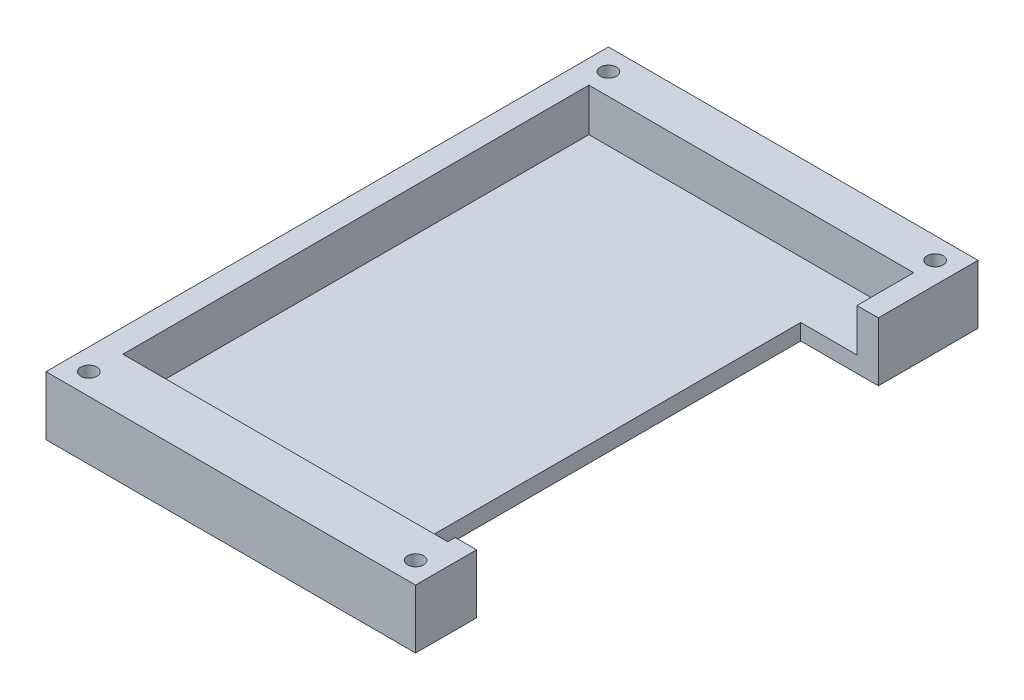
ISO-10303-21;
HEADER;
FILE_DESCRIPTION(('STEP AP214'),'2;1');
FILE_NAME('part.step','',(''),(''),'','','');
FILE_SCHEMA(('AUTOMOTIVE_DESIGN { 1 0 10303 214 1 1 1 1 }'));
ENDSEC;
DATA;
#1=APPLICATION_CONTEXT('core data for automotive mechanical design processes');
#2=APPLICATION_PROTOCOL_DEFINITION('international standard','automotive_design',2000,#1);
#3=PRODUCT_CONTEXT('',#1,'mechanical');
#4=PRODUCT('Part','Part','',(#3));
#5=PRODUCT_RELATED_PRODUCT_CATEGORY('part','',(#4));
#6=PRODUCT_DEFINITION_FORMATION('','',#4);
#7=PRODUCT_DEFINITION_CONTEXT('part definition',#1,'design');
#8=PRODUCT_DEFINITION('design','',#6,#7);
#9=PRODUCT_DEFINITION_SHAPE('','',#8);
#10=(LENGTH_UNIT() NAMED_UNIT(*) SI_UNIT(.MILLI.,.METRE.));
#11=(NAMED_UNIT(*) PLANE_ANGLE_UNIT() SI_UNIT($,.RADIAN.));
#12=(NAMED_UNIT(*) SI_UNIT($,.STERADIAN.) SOLID_ANGLE_UNIT());
#13=UNCERTAINTY_MEASURE_WITH_UNIT(LENGTH_MEASURE(1.E-05),#10,'distance_accuracy_value','');
#14=(GEOMETRIC_REPRESENTATION_CONTEXT(3) GLOBAL_UNCERTAINTY_ASSIGNED_CONTEXT((#13)) GLOBAL_UNIT_ASSIGNED_CONTEXT((#10,
#11,#12)) REPRESENTATION_CONTEXT('',''));
#15=CARTESIAN_POINT('',(0.,0.,0.));
#16=DIRECTION('',(0.,0.,1.));
#17=DIRECTION('',(1.,0.,0.));
#18=AXIS2_PLACEMENT_3D('',#15,#16,#17);
#19=CARTESIAN_POINT('',(69.,11.,0.));
#20=DIRECTION('',(-1.,0.,0.));
#21=DIRECTION('',(0.,0.,1.));
#22=AXIS2_PLACEMENT_3D('',#19,#20,#21);
#23=PLANE('',#22);
#24=DIRECTION('',(0.,0.,-1.));
#25=VECTOR('',#24,1.);
#26=CARTESIAN_POINT('',(69.,0.,0.));
#27=LINE('',#26,#25);
#28=CARTESIAN_POINT('',(69.,0.,0.));
#29=VERTEX_POINT('',#28);
#30=CARTESIAN_POINT('',(69.,0.,-11.4));
#31=VERTEX_POINT('',#30);
#32=EDGE_CURVE('E162',#29,#31,#27,.T.);
#33=ORIENTED_EDGE('',*,*,#32,.T.);
#34=DIRECTION('',(0.,1.,0.));
#35=VECTOR('',#34,1.);
#36=CARTESIAN_POINT('',(69.,0.,-11.4));
#37=LINE('',#36,#35);
#38=CARTESIAN_POINT('',(69.,11.,-11.4));
#39=VERTEX_POINT('',#38);
#40=EDGE_CURVE('E196',#31,#39,#37,.T.);
#41=ORIENTED_EDGE('',*,*,#40,.T.);
#42=DIRECTION('',(0.,0.,-1.));
#43=VECTOR('',#42,1.);
#44=CARTESIAN_POINT('',(69.,11.,0.));
#45=LINE('',#44,#43);
#46=CARTESIAN_POINT('',(69.,11.,0.));
#47=VERTEX_POINT('',#46);
#48=EDGE_CURVE('E241',#47,#39,#45,.T.);
#49=ORIENTED_EDGE('',*,*,#48,.F.);
#50=DIRECTION('',(0.,-1.,0.));
#51=VECTOR('',#50,1.);
#52=CARTESIAN_POINT('',(69.,11.,0.));
#53=LINE('',#52,#51);
#54=EDGE_CURVE('E178',#47,#29,#53,.T.);
#55=ORIENTED_EDGE('',*,*,#54,.T.);
#56=EDGE_LOOP('',(#33,#41,#49,#55));
#57=FACE_BOUND('',#56,.T.);
#58=ADVANCED_FACE('F35',(#57),#23,.F.);
#59=CARTESIAN_POINT('',(65.,3.,-97.));
#60=DIRECTION('',(1.,0.,0.));
#61=DIRECTION('',(0.,0.,-1.));
#62=AXIS2_PLACEMENT_3D('',#59,#60,#61);
#63=PLANE('',#62);
#64=DIRECTION('',(0.,0.,-1.));
#65=VECTOR('',#64,1.);
#66=CARTESIAN_POINT('',(65.,11.,-97.));
#67=LINE('',#66,#65);
#68=CARTESIAN_POINT('',(65.,11.,-10.));
#69=VERTEX_POINT('',#68);
#70=CARTESIAN_POINT('',(65.,11.,-11.4));
#71=VERTEX_POINT('',#70);
#72=EDGE_CURVE('E222',#69,#71,#67,.T.);
#73=ORIENTED_EDGE('',*,*,#72,.T.);
#74=DIRECTION('',(0.,-1.,0.));
#75=VECTOR('',#74,1.);
#76=CARTESIAN_POINT('',(65.,3.,-11.4));
#77=LINE('',#76,#75);
#78=CARTESIAN_POINT('',(65.,3.,-11.4));
#79=VERTEX_POINT('',#78);
#80=EDGE_CURVE('E434',#71,#79,#77,.T.);
#81=ORIENTED_EDGE('',*,*,#80,.T.);
#82=DIRECTION('',(0.,0.,-1.));
#83=VECTOR('',#82,1.);
#84=CARTESIAN_POINT('',(65.,3.,-97.));
#85=LINE('',#84,#83);
#86=CARTESIAN_POINT('',(65.,3.,-10.));
#87=VERTEX_POINT('',#86);
#88=EDGE_CURVE('E202',#87,#79,#85,.T.);
#89=ORIENTED_EDGE('',*,*,#88,.F.);
#90=DIRECTION('',(0.,1.,0.));
#91=VECTOR('',#90,1.);
#92=CARTESIAN_POINT('',(65.,3.,-10.));
#93=LINE('',#92,#91);
#94=EDGE_CURVE('E234',#87,#69,#93,.T.);
#95=ORIENTED_EDGE('',*,*,#94,.T.);
#96=EDGE_LOOP('',(#73,#81,#89,#95));
#97=FACE_BOUND('',#96,.T.);
#98=ADVANCED_FACE('F270',(#97),#63,.F.);
#99=CARTESIAN_POINT('',(0.,11.,0.));
#100=DIRECTION('',(1.,0.,0.));
#101=DIRECTION('',(0.,0.,-1.));
#102=AXIS2_PLACEMENT_3D('',#99,#100,#101);
#103=PLANE('',#102);
#104=DIRECTION('',(0.,0.,1.));
#105=VECTOR('',#104,1.);
#106=CARTESIAN_POINT('',(0.,0.,0.));
#107=LINE('',#106,#105);
#108=CARTESIAN_POINT('',(0.,0.,-105.));
#109=VERTEX_POINT('',#108);
#110=CARTESIAN_POINT('',(0.,0.,0.));
#111=VERTEX_POINT('',#110);
#112=EDGE_CURVE('E166',#109,#111,#107,.T.);
#113=ORIENTED_EDGE('',*,*,#112,.T.);
#114=DIRECTION('',(0.,-1.,0.));
#115=VECTOR('',#114,1.);
#116=CARTESIAN_POINT('',(0.,11.,0.));
#117=LINE('',#116,#115);
#118=CARTESIAN_POINT('',(0.,11.,0.));
#119=VERTEX_POINT('',#118);
#120=EDGE_CURVE('E181',#119,#111,#117,.T.);
#121=ORIENTED_EDGE('',*,*,#120,.F.);
#122=DIRECTION('',(0.,0.,1.));
#123=VECTOR('',#122,1.);
#124=CARTESIAN_POINT('',(0.,11.,0.));
#125=LINE('',#124,#123);
#126=CARTESIAN_POINT('',(0.,11.,-105.));
#127=VERTEX_POINT('',#126);
#128=EDGE_CURVE('E171',#127,#119,#125,.T.);
#129=ORIENTED_EDGE('',*,*,#128,.F.);
#130=DIRECTION('',(0.,-1.,0.));
#131=VECTOR('',#130,1.);
#132=CARTESIAN_POINT('',(0.,11.,-105.));
#133=LINE('',#132,#131);
#134=EDGE_CURVE('E172',#127,#109,#133,.T.);
#135=ORIENTED_EDGE('',*,*,#134,.T.);
#136=EDGE_LOOP('',(#113,#121,#129,#135));
#137=FACE_BOUND('',#136,.T.);
#138=ADVANCED_FACE('F37',(#137),#103,.F.);
#139=CARTESIAN_POINT('',(0.,11.,0.));
#140=DIRECTION('',(0.,0.,-1.));
#141=DIRECTION('',(-1.,0.,0.));
#142=AXIS2_PLACEMENT_3D('',#139,#140,#141);
#143=PLANE('',#142);
#144=DIRECTION('',(1.,0.,0.));
#145=VECTOR('',#144,1.);
#146=CARTESIAN_POINT('',(0.,0.,0.));
#147=LINE('',#146,#145);
#148=EDGE_CURVE('E163',#111,#29,#147,.T.);
#149=ORIENTED_EDGE('',*,*,#148,.T.);
#150=ORIENTED_EDGE('',*,*,#54,.F.);
#151=DIRECTION('',(1.,0.,0.));
#152=VECTOR('',#151,1.);
#153=CARTESIAN_POINT('',(0.,11.,0.));
#154=LINE('',#153,#152);
#155=EDGE_CURVE('E239',#119,#47,#154,.T.);
#156=ORIENTED_EDGE('',*,*,#155,.F.);
#157=ORIENTED_EDGE('',*,*,#120,.T.);
#158=EDGE_LOOP('',(#149,#150,#156,#157));
#159=FACE_BOUND('',#158,.T.);
#160=ADVANCED_FACE('F252',(#159),#143,.F.);
#161=CARTESIAN_POINT('',(69.,11.,-86.4));
#162=VERTEX_POINT('',#161);
#163=CARTESIAN_POINT('',(69.,11.,-105.));
#164=VERTEX_POINT('',#163);
#165=EDGE_CURVE('E153',#162,#164,#45,.T.);
#166=ORIENTED_EDGE('',*,*,#165,.F.);
#167=DIRECTION('',(0.,1.,0.));
#168=VECTOR('',#167,1.);
#169=CARTESIAN_POINT('',(69.,0.,-86.4));
#170=LINE('',#169,#168);
#171=CARTESIAN_POINT('',(69.,0.,-86.4));
#172=VERTEX_POINT('',#171);
#173=EDGE_CURVE('E136',#172,#162,#170,.T.);
#174=ORIENTED_EDGE('',*,*,#173,.F.);
#175=CARTESIAN_POINT('',(69.,0.,-105.));
#176=VERTEX_POINT('',#175);
#177=EDGE_CURVE('E151',#172,#176,#27,.T.);
#178=ORIENTED_EDGE('',*,*,#177,.T.);
#179=DIRECTION('',(0.,-1.,0.));
#180=VECTOR('',#179,1.);
#181=CARTESIAN_POINT('',(69.,11.,-105.));
#182=LINE('',#181,#180);
#183=EDGE_CURVE('E175',#164,#176,#182,.T.);
#184=ORIENTED_EDGE('',*,*,#183,.F.);
#185=EDGE_LOOP('',(#166,#174,#178,#184));
#186=FACE_BOUND('',#185,.T.);
#187=ADVANCED_FACE('F149',(#186),#23,.F.);
#188=CARTESIAN_POINT('',(0.,11.,-105.));
#189=DIRECTION('',(0.,0.,1.));
#190=DIRECTION('',(1.,0.,0.));
#191=AXIS2_PLACEMENT_3D('',#188,#189,#190);
#192=PLANE('',#191);
#193=DIRECTION('',(-1.,0.,0.));
#194=VECTOR('',#193,1.);
#195=CARTESIAN_POINT('',(0.,0.,-105.));
#196=LINE('',#195,#194);
#197=EDGE_CURVE('E161',#176,#109,#196,.T.);
#198=ORIENTED_EDGE('',*,*,#197,.T.);
#199=ORIENTED_EDGE('',*,*,#134,.F.);
#200=DIRECTION('',(-1.,0.,0.));
#201=VECTOR('',#200,1.);
#202=CARTESIAN_POINT('',(0.,11.,-105.));
#203=LINE('',#202,#201);
#204=EDGE_CURVE('E176',#164,#127,#203,.T.);
#205=ORIENTED_EDGE('',*,*,#204,.F.);
#206=ORIENTED_EDGE('',*,*,#183,.T.);
#207=EDGE_LOOP('',(#198,#199,#205,#206));
#208=FACE_BOUND('',#207,.T.);
#209=ADVANCED_FACE('F258',(#208),#192,.F.);
#210=CARTESIAN_POINT('',(0.,11.,0.));
#211=DIRECTION('',(0.,-1.,0.));
#212=DIRECTION('',(0.,0.,-1.));
#213=AXIS2_PLACEMENT_3D('',#210,#211,#212);
#214=PLANE('',#213);
#215=CARTESIAN_POINT('',(65.,11.,-4.));
#216=DIRECTION('',(0.,1.,0.));
#217=DIRECTION('',(0.,0.,1.));
#218=AXIS2_PLACEMENT_3D('',#215,#216,#217);
#219=CIRCLE('',#218,1.5);
#220=CARTESIAN_POINT('',(65.,11.,-2.5));
#221=VERTEX_POINT('',#220);
#222=EDGE_CURVE('E435',#221,#221,#219,.T.);
#223=ORIENTED_EDGE('',*,*,#222,.F.);
#224=EDGE_LOOP('',(#223));
#225=FACE_BOUND('',#224,.T.);
#226=CARTESIAN_POINT('',(4.,11.,-4.));
#227=DIRECTION('',(0.,1.,0.));
#228=DIRECTION('',(0.,0.,1.));
#229=AXIS2_PLACEMENT_3D('',#226,#227,#228);
#230=CIRCLE('',#229,1.5);
#231=CARTESIAN_POINT('',(4.,11.,-2.5));
#232=VERTEX_POINT('',#231);
#233=EDGE_CURVE('E443',#232,#232,#230,.T.);
#234=ORIENTED_EDGE('',*,*,#233,.F.);
#235=EDGE_LOOP('',(#234));
#236=FACE_BOUND('',#235,.T.);
#237=CARTESIAN_POINT('',(65.,11.,-101.));
#238=DIRECTION('',(0.,1.,0.));
#239=DIRECTION('',(0.,0.,1.));
#240=AXIS2_PLACEMENT_3D('',#237,#238,#239);
#241=CIRCLE('',#240,1.5);
#242=CARTESIAN_POINT('',(65.,11.,-99.5));
#243=VERTEX_POINT('',#242);
#244=EDGE_CURVE('E448',#243,#243,#241,.T.);
#245=ORIENTED_EDGE('',*,*,#244,.F.);
#246=EDGE_LOOP('',(#245));
#247=FACE_BOUND('',#246,.T.);
#248=CARTESIAN_POINT('',(4.,11.,-101.));
#249=DIRECTION('',(0.,1.,0.));
#250=DIRECTION('',(0.,0.,1.));
#251=AXIS2_PLACEMENT_3D('',#248,#249,#250);
#252=CIRCLE('',#251,1.5);
#253=CARTESIAN_POINT('',(4.,11.,-99.5));
#254=VERTEX_POINT('',#253);
#255=EDGE_CURVE('E454',#254,#254,#252,.T.);
#256=ORIENTED_EDGE('',*,*,#255,.F.);
#257=EDGE_LOOP('',(#256));
#258=FACE_BOUND('',#257,.T.);
#259=ORIENTED_EDGE('',*,*,#48,.T.);
#260=DIRECTION('',(1.,0.,0.));
#261=VECTOR('',#260,1.);
#262=CARTESIAN_POINT('',(69.,11.,-11.4));
#263=LINE('',#262,#261);
#264=EDGE_CURVE('E145',#71,#39,#263,.T.);
#265=ORIENTED_EDGE('',*,*,#264,.F.);
#266=ORIENTED_EDGE('',*,*,#72,.F.);
#267=DIRECTION('',(1.,0.,0.));
#268=VECTOR('',#267,1.);
#269=CARTESIAN_POINT('',(4.35799406933946,11.,-10.));
#270=LINE('',#269,#268);
#271=CARTESIAN_POINT('',(4.35799406933946,11.,-10.));
#272=VERTEX_POINT('',#271);
#273=EDGE_CURVE('E217',#272,#69,#270,.T.);
#274=ORIENTED_EDGE('',*,*,#273,.F.);
#275=DIRECTION('',(0.,0.,1.));
#276=VECTOR('',#275,1.);
#277=CARTESIAN_POINT('',(4.35799406933945,11.,-97.));
#278=LINE('',#277,#276);
#279=CARTESIAN_POINT('',(4.35799406933945,11.,-97.));
#280=VERTEX_POINT('',#279);
#281=EDGE_CURVE('E58',#280,#272,#278,.T.);
#282=ORIENTED_EDGE('',*,*,#281,.F.);
#283=DIRECTION('',(-1.,0.,0.));
#284=VECTOR('',#283,1.);
#285=CARTESIAN_POINT('',(4.35799406933945,11.,-97.));
#286=LINE('',#285,#284);
#287=CARTESIAN_POINT('',(65.,11.,-97.));
#288=VERTEX_POINT('',#287);
#289=EDGE_CURVE('E225',#288,#280,#286,.T.);
#290=ORIENTED_EDGE('',*,*,#289,.F.);
#291=CARTESIAN_POINT('',(65.,11.,-86.4));
#292=VERTEX_POINT('',#291);
#293=EDGE_CURVE('E221',#292,#288,#67,.T.);
#294=ORIENTED_EDGE('',*,*,#293,.F.);
#295=DIRECTION('',(-1.,0.,0.));
#296=VECTOR('',#295,1.);
#297=CARTESIAN_POINT('',(69.,11.,-86.4));
#298=LINE('',#297,#296);
#299=EDGE_CURVE('E465',#162,#292,#298,.T.);
#300=ORIENTED_EDGE('',*,*,#299,.F.);
#301=ORIENTED_EDGE('',*,*,#165,.T.);
#302=ORIENTED_EDGE('',*,*,#204,.T.);
#303=ORIENTED_EDGE('',*,*,#128,.T.);
#304=ORIENTED_EDGE('',*,*,#155,.T.);
#305=EDGE_LOOP('',(#259,#265,#266,#274,#282,#290,#294,#300,#301,#302,#303,#304));
#306=FACE_BOUND('',#305,.T.);
#307=ADVANCED_FACE('F255',(#225,#236,#247,#258,#306),#214,.F.);
#308=CARTESIAN_POINT('',(0.,0.,0.));
#309=DIRECTION('',(0.,-1.,0.));
#310=DIRECTION('',(0.,0.,-1.));
#311=AXIS2_PLACEMENT_3D('',#308,#309,#310);
#312=PLANE('',#311);
#313=DIRECTION('',(1.,0.,0.));
#314=VECTOR('',#313,1.);
#315=CARTESIAN_POINT('',(69.,0.,-11.4));
#316=LINE('',#315,#314);
#317=CARTESIAN_POINT('',(54.5,0.,-11.4));
#318=VERTEX_POINT('',#317);
#319=EDGE_CURVE('E154',#318,#31,#316,.T.);
#320=ORIENTED_EDGE('',*,*,#319,.T.);
#321=ORIENTED_EDGE('',*,*,#32,.F.);
#322=ORIENTED_EDGE('',*,*,#148,.F.);
#323=ORIENTED_EDGE('',*,*,#112,.F.);
#324=ORIENTED_EDGE('',*,*,#197,.F.);
#325=ORIENTED_EDGE('',*,*,#177,.F.);
#326=DIRECTION('',(-1.,0.,0.));
#327=VECTOR('',#326,1.);
#328=CARTESIAN_POINT('',(69.,0.,-86.4));
#329=LINE('',#328,#327);
#330=CARTESIAN_POINT('',(54.5,0.,-86.4));
#331=VERTEX_POINT('',#330);
#332=EDGE_CURVE('E133',#172,#331,#329,.T.);
#333=ORIENTED_EDGE('',*,*,#332,.T.);
#334=DIRECTION('',(0.,0.,1.));
#335=VECTOR('',#334,1.);
#336=CARTESIAN_POINT('',(54.5,0.,-86.4));
#337=LINE('',#336,#335);
#338=EDGE_CURVE('E144',#331,#318,#337,.T.);
#339=ORIENTED_EDGE('',*,*,#338,.T.);
#340=EDGE_LOOP('',(#320,#321,#322,#323,#324,#325,#333,#339));
#341=FACE_BOUND('',#340,.T.);
#342=CARTESIAN_POINT('',(65.,0.,-4.));
#343=DIRECTION('',(0.,1.,0.));
#344=DIRECTION('',(0.,0.,1.));
#345=AXIS2_PLACEMENT_3D('',#342,#343,#344);
#346=CIRCLE('',#345,1.5);
#347=CARTESIAN_POINT('',(65.,0.,-2.5));
#348=VERTEX_POINT('',#347);
#349=EDGE_CURVE('E438',#348,#348,#346,.T.);
#350=ORIENTED_EDGE('',*,*,#349,.T.);
#351=EDGE_LOOP('',(#350));
#352=FACE_BOUND('',#351,.T.);
#353=CARTESIAN_POINT('',(4.,0.,-4.));
#354=DIRECTION('',(0.,1.,0.));
#355=DIRECTION('',(0.,0.,1.));
#356=AXIS2_PLACEMENT_3D('',#353,#354,#355);
#357=CIRCLE('',#356,1.5);
#358=CARTESIAN_POINT('',(4.,0.,-2.5));
#359=VERTEX_POINT('',#358);
#360=EDGE_CURVE('E445',#359,#359,#357,.T.);
#361=ORIENTED_EDGE('',*,*,#360,.T.);
#362=EDGE_LOOP('',(#361));
#363=FACE_BOUND('',#362,.T.);
#364=CARTESIAN_POINT('',(65.,0.,-101.));
#365=DIRECTION('',(0.,1.,0.));
#366=DIRECTION('',(0.,0.,1.));
#367=AXIS2_PLACEMENT_3D('',#364,#365,#366);
#368=CIRCLE('',#367,1.5);
#369=CARTESIAN_POINT('',(65.,0.,-99.5));
#370=VERTEX_POINT('',#369);
#371=EDGE_CURVE('E451',#370,#370,#368,.T.);
#372=ORIENTED_EDGE('',*,*,#371,.T.);
#373=EDGE_LOOP('',(#372));
#374=FACE_BOUND('',#373,.T.);
#375=CARTESIAN_POINT('',(4.,0.,-101.));
#376=DIRECTION('',(0.,1.,0.));
#377=DIRECTION('',(0.,0.,1.));
#378=AXIS2_PLACEMENT_3D('',#375,#376,#377);
#379=CIRCLE('',#378,1.5);
#380=CARTESIAN_POINT('',(4.,0.,-99.5));
#381=VERTEX_POINT('',#380);
#382=EDGE_CURVE('E218',#381,#381,#379,.T.);
#383=ORIENTED_EDGE('',*,*,#382,.T.);
#384=EDGE_LOOP('',(#383));
#385=FACE_BOUND('',#384,.T.);
#386=ADVANCED_FACE('F158',(#341,#352,#363,#374,#385),#312,.T.);
#387=CARTESIAN_POINT('',(4.35799406933945,3.,-97.));
#388=DIRECTION('',(-1.,0.,0.));
#389=DIRECTION('',(0.,0.,1.));
#390=AXIS2_PLACEMENT_3D('',#387,#388,#389);
#391=PLANE('',#390);
#392=ORIENTED_EDGE('',*,*,#281,.T.);
#393=DIRECTION('',(0.,1.,0.));
#394=VECTOR('',#393,1.);
#395=CARTESIAN_POINT('',(4.35799406933946,3.,-10.));
#396=LINE('',#395,#394);
#397=CARTESIAN_POINT('',(4.35799406933946,3.,-10.));
#398=VERTEX_POINT('',#397);
#399=EDGE_CURVE('E211',#398,#272,#396,.T.);
#400=ORIENTED_EDGE('',*,*,#399,.F.);
#401=DIRECTION('',(0.,0.,1.));
#402=VECTOR('',#401,1.);
#403=CARTESIAN_POINT('',(4.35799406933945,3.,-97.));
#404=LINE('',#403,#402);
#405=CARTESIAN_POINT('',(4.35799406933945,3.,-97.));
#406=VERTEX_POINT('',#405);
#407=EDGE_CURVE('E228',#406,#398,#404,.T.);
#408=ORIENTED_EDGE('',*,*,#407,.F.);
#409=DIRECTION('',(0.,1.,0.));
#410=VECTOR('',#409,1.);
#411=CARTESIAN_POINT('',(4.35799406933945,3.,-97.));
#412=LINE('',#411,#410);
#413=EDGE_CURVE('E229',#406,#280,#412,.T.);
#414=ORIENTED_EDGE('',*,*,#413,.T.);
#415=EDGE_LOOP('',(#392,#400,#408,#414));
#416=FACE_BOUND('',#415,.T.);
#417=ADVANCED_FACE('F314',(#416),#391,.F.);
#418=CARTESIAN_POINT('',(4.35799406933945,3.,-97.));
#419=DIRECTION('',(0.,0.,-1.));
#420=DIRECTION('',(-1.,0.,0.));
#421=AXIS2_PLACEMENT_3D('',#418,#419,#420);
#422=PLANE('',#421);
#423=ORIENTED_EDGE('',*,*,#289,.T.);
#424=ORIENTED_EDGE('',*,*,#413,.F.);
#425=DIRECTION('',(-1.,0.,0.));
#426=VECTOR('',#425,1.);
#427=CARTESIAN_POINT('',(4.35799406933945,3.,-97.));
#428=LINE('',#427,#426);
#429=CARTESIAN_POINT('',(65.,3.,-97.));
#430=VERTEX_POINT('',#429);
#431=EDGE_CURVE('E207',#430,#406,#428,.T.);
#432=ORIENTED_EDGE('',*,*,#431,.F.);
#433=DIRECTION('',(0.,1.,0.));
#434=VECTOR('',#433,1.);
#435=CARTESIAN_POINT('',(65.,3.,-97.));
#436=LINE('',#435,#434);
#437=EDGE_CURVE('E231',#430,#288,#436,.T.);
#438=ORIENTED_EDGE('',*,*,#437,.T.);
#439=EDGE_LOOP('',(#423,#424,#432,#438));
#440=FACE_BOUND('',#439,.T.);
#441=ADVANCED_FACE('F325',(#440),#422,.F.);
#442=CARTESIAN_POINT('',(65.,3.,-86.4));
#443=VERTEX_POINT('',#442);
#444=EDGE_CURVE('E208',#443,#430,#85,.T.);
#445=ORIENTED_EDGE('',*,*,#444,.F.);
#446=DIRECTION('',(0.,1.,0.));
#447=VECTOR('',#446,1.);
#448=CARTESIAN_POINT('',(65.,3.,-86.4));
#449=LINE('',#448,#447);
#450=EDGE_CURVE('E50',#443,#292,#449,.T.);
#451=ORIENTED_EDGE('',*,*,#450,.T.);
#452=ORIENTED_EDGE('',*,*,#293,.T.);
#453=ORIENTED_EDGE('',*,*,#437,.F.);
#454=EDGE_LOOP('',(#445,#451,#452,#453));
#455=FACE_BOUND('',#454,.T.);
#456=ADVANCED_FACE('F276',(#455),#63,.F.);
#457=CARTESIAN_POINT('',(4.35799406933946,3.,-10.));
#458=DIRECTION('',(0.,0.,1.));
#459=DIRECTION('',(1.,0.,0.));
#460=AXIS2_PLACEMENT_3D('',#457,#458,#459);
#461=PLANE('',#460);
#462=ORIENTED_EDGE('',*,*,#273,.T.);
#463=ORIENTED_EDGE('',*,*,#94,.F.);
#464=DIRECTION('',(1.,0.,0.));
#465=VECTOR('',#464,1.);
#466=CARTESIAN_POINT('',(4.35799406933946,3.,-10.));
#467=LINE('',#466,#465);
#468=EDGE_CURVE('E205',#398,#87,#467,.T.);
#469=ORIENTED_EDGE('',*,*,#468,.F.);
#470=ORIENTED_EDGE('',*,*,#399,.T.);
#471=EDGE_LOOP('',(#462,#463,#469,#470));
#472=FACE_BOUND('',#471,.T.);
#473=ADVANCED_FACE('F324',(#472),#461,.F.);
#474=CARTESIAN_POINT('',(0.,3.,0.));
#475=DIRECTION('',(0.,1.,0.));
#476=DIRECTION('',(0.,0.,1.));
#477=AXIS2_PLACEMENT_3D('',#474,#475,#476);
#478=PLANE('',#477);
#479=DIRECTION('',(1.,0.,0.));
#480=VECTOR('',#479,1.);
#481=CARTESIAN_POINT('',(0.,3.,-11.4));
#482=LINE('',#481,#480);
#483=CARTESIAN_POINT('',(54.5,3.,-11.4));
#484=VERTEX_POINT('',#483);
#485=EDGE_CURVE('E11',#484,#79,#482,.T.);
#486=ORIENTED_EDGE('',*,*,#485,.F.);
#487=DIRECTION('',(0.,0.,1.));
#488=VECTOR('',#487,1.);
#489=CARTESIAN_POINT('',(54.5,3.,0.));
#490=LINE('',#489,#488);
#491=CARTESIAN_POINT('',(54.5,3.,-86.4));
#492=VERTEX_POINT('',#491);
#493=EDGE_CURVE('E43',#492,#484,#490,.T.);
#494=ORIENTED_EDGE('',*,*,#493,.F.);
#495=DIRECTION('',(-1.,0.,0.));
#496=VECTOR('',#495,1.);
#497=CARTESIAN_POINT('',(0.,3.,-86.4));
#498=LINE('',#497,#496);
#499=EDGE_CURVE('E184',#443,#492,#498,.T.);
#500=ORIENTED_EDGE('',*,*,#499,.F.);
#501=ORIENTED_EDGE('',*,*,#444,.T.);
#502=ORIENTED_EDGE('',*,*,#431,.T.);
#503=ORIENTED_EDGE('',*,*,#407,.T.);
#504=ORIENTED_EDGE('',*,*,#468,.T.);
#505=ORIENTED_EDGE('',*,*,#88,.T.);
#506=EDGE_LOOP('',(#486,#494,#500,#501,#502,#503,#504,#505));
#507=FACE_BOUND('',#506,.T.);
#508=ADVANCED_FACE('F199',(#507),#478,.T.);
#509=CARTESIAN_POINT('',(4.,0.,-101.));
#510=DIRECTION('',(0.,1.,0.));
#511=DIRECTION('',(0.,0.,1.));
#512=AXIS2_PLACEMENT_3D('',#509,#510,#511);
#513=CYLINDRICAL_SURFACE('',#512,1.5);
#514=ORIENTED_EDGE('',*,*,#382,.F.);
#515=EDGE_LOOP('',(#514));
#516=FACE_BOUND('',#515,.T.);
#517=ORIENTED_EDGE('',*,*,#255,.T.);
#518=EDGE_LOOP('',(#517));
#519=FACE_BOUND('',#518,.T.);
#520=ADVANCED_FACE('F338',(#516,#519),#513,.F.);
#521=CARTESIAN_POINT('',(65.,0.,-101.));
#522=DIRECTION('',(0.,1.,0.));
#523=DIRECTION('',(0.,0.,1.));
#524=AXIS2_PLACEMENT_3D('',#521,#522,#523);
#525=CYLINDRICAL_SURFACE('',#524,1.5);
#526=ORIENTED_EDGE('',*,*,#371,.F.);
#527=EDGE_LOOP('',(#526));
#528=FACE_BOUND('',#527,.T.);
#529=ORIENTED_EDGE('',*,*,#244,.T.);
#530=EDGE_LOOP('',(#529));
#531=FACE_BOUND('',#530,.T.);
#532=ADVANCED_FACE('F376',(#528,#531),#525,.F.);
#533=CARTESIAN_POINT('',(4.,0.,-4.));
#534=DIRECTION('',(0.,1.,0.));
#535=DIRECTION('',(0.,0.,1.));
#536=AXIS2_PLACEMENT_3D('',#533,#534,#535);
#537=CYLINDRICAL_SURFACE('',#536,1.5);
#538=ORIENTED_EDGE('',*,*,#360,.F.);
#539=EDGE_LOOP('',(#538));
#540=FACE_BOUND('',#539,.T.);
#541=ORIENTED_EDGE('',*,*,#233,.T.);
#542=EDGE_LOOP('',(#541));
#543=FACE_BOUND('',#542,.T.);
#544=ADVANCED_FACE('F372',(#540,#543),#537,.F.);
#545=CARTESIAN_POINT('',(65.,0.,-4.));
#546=DIRECTION('',(0.,1.,0.));
#547=DIRECTION('',(0.,0.,1.));
#548=AXIS2_PLACEMENT_3D('',#545,#546,#547);
#549=CYLINDRICAL_SURFACE('',#548,1.5);
#550=ORIENTED_EDGE('',*,*,#349,.F.);
#551=EDGE_LOOP('',(#550));
#552=FACE_BOUND('',#551,.T.);
#553=ORIENTED_EDGE('',*,*,#222,.T.);
#554=EDGE_LOOP('',(#553));
#555=FACE_BOUND('',#554,.T.);
#556=ADVANCED_FACE('F349',(#552,#555),#549,.F.);
#557=CARTESIAN_POINT('',(69.,0.,-11.4));
#558=DIRECTION('',(0.,0.,1.));
#559=DIRECTION('',(1.,0.,0.));
#560=AXIS2_PLACEMENT_3D('',#557,#558,#559);
#561=PLANE('',#560);
#562=ORIENTED_EDGE('',*,*,#264,.T.);
#563=ORIENTED_EDGE('',*,*,#40,.F.);
#564=ORIENTED_EDGE('',*,*,#319,.F.);
#565=DIRECTION('',(0.,1.,0.));
#566=VECTOR('',#565,1.);
#567=CARTESIAN_POINT('',(54.5,0.,-11.4));
#568=LINE('',#567,#566);
#569=EDGE_CURVE('E189',#318,#484,#568,.T.);
#570=ORIENTED_EDGE('',*,*,#569,.T.);
#571=ORIENTED_EDGE('',*,*,#485,.T.);
#572=ORIENTED_EDGE('',*,*,#80,.F.);
#573=EDGE_LOOP('',(#562,#563,#564,#570,#571,#572));
#574=FACE_BOUND('',#573,.T.);
#575=ADVANCED_FACE('F194',(#574),#561,.F.);
#576=CARTESIAN_POINT('',(69.,0.,-86.4));
#577=DIRECTION('',(0.,0.,-1.));
#578=DIRECTION('',(-1.,0.,0.));
#579=AXIS2_PLACEMENT_3D('',#576,#577,#578);
#580=PLANE('',#579);
#581=ORIENTED_EDGE('',*,*,#499,.T.);
#582=DIRECTION('',(0.,1.,0.));
#583=VECTOR('',#582,1.);
#584=CARTESIAN_POINT('',(54.5,0.,-86.4));
#585=LINE('',#584,#583);
#586=EDGE_CURVE('E139',#331,#492,#585,.T.);
#587=ORIENTED_EDGE('',*,*,#586,.F.);
#588=ORIENTED_EDGE('',*,*,#332,.F.);
#589=ORIENTED_EDGE('',*,*,#173,.T.);
#590=ORIENTED_EDGE('',*,*,#299,.T.);
#591=ORIENTED_EDGE('',*,*,#450,.F.);
#592=EDGE_LOOP('',(#581,#587,#588,#589,#590,#591));
#593=FACE_BOUND('',#592,.T.);
#594=ADVANCED_FACE('F135',(#593),#580,.F.);
#595=CARTESIAN_POINT('',(54.5,0.,-86.4));
#596=DIRECTION('',(-1.,0.,0.));
#597=DIRECTION('',(0.,0.,1.));
#598=AXIS2_PLACEMENT_3D('',#595,#596,#597);
#599=PLANE('',#598);
#600=ORIENTED_EDGE('',*,*,#493,.T.);
#601=ORIENTED_EDGE('',*,*,#569,.F.);
#602=ORIENTED_EDGE('',*,*,#338,.F.);
#603=ORIENTED_EDGE('',*,*,#586,.T.);
#604=EDGE_LOOP('',(#600,#601,#602,#603));
#605=FACE_BOUND('',#604,.T.);
#606=ADVANCED_FACE('F188',(#605),#599,.F.);
#607=CLOSED_SHELL('',(#58,#98,#138,#160,#187,#209,#307,#386,#417,#441,#456,#473,#508,#520,#532,
#544,#556,#575,#594,#606));
#608=MANIFOLD_SOLID_BREP('B2',#607);
#609=ADVANCED_BREP_SHAPE_REPRESENTATION('',(#18,#608),#14);
#610=SHAPE_DEFINITION_REPRESENTATION(#9,#609);
ENDSEC;
END-ISO-10303-21;
